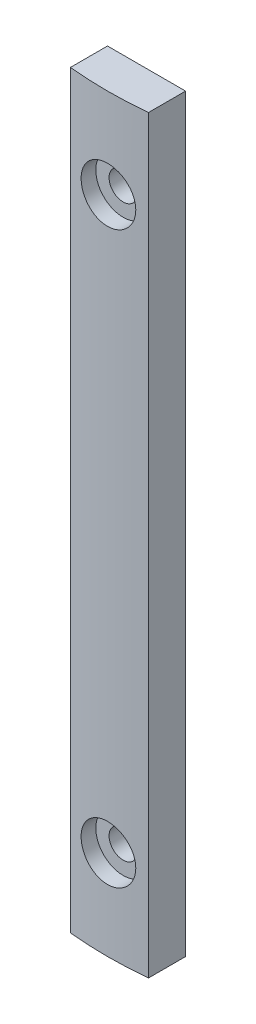
ISO-10303-21;
HEADER;
FILE_DESCRIPTION(('STEP AP214'),'2;1');
FILE_NAME('part.step','',(''),(''),'','','');
FILE_SCHEMA(('AUTOMOTIVE_DESIGN { 1 0 10303 214 1 1 1 1 }'));
ENDSEC;
DATA;
#1=APPLICATION_CONTEXT('core data for automotive mechanical design processes');
#2=APPLICATION_PROTOCOL_DEFINITION('international standard','automotive_design',2000,#1);
#3=PRODUCT_CONTEXT('',#1,'mechanical');
#4=PRODUCT('Part','Part','',(#3));
#5=PRODUCT_RELATED_PRODUCT_CATEGORY('part','',(#4));
#6=PRODUCT_DEFINITION_FORMATION('','',#4);
#7=PRODUCT_DEFINITION_CONTEXT('part definition',#1,'design');
#8=PRODUCT_DEFINITION('design','',#6,#7);
#9=PRODUCT_DEFINITION_SHAPE('','',#8);
#10=(LENGTH_UNIT() NAMED_UNIT(*) SI_UNIT(.MILLI.,.METRE.));
#11=(NAMED_UNIT(*) PLANE_ANGLE_UNIT() SI_UNIT($,.RADIAN.));
#12=(NAMED_UNIT(*) SI_UNIT($,.STERADIAN.) SOLID_ANGLE_UNIT());
#13=UNCERTAINTY_MEASURE_WITH_UNIT(LENGTH_MEASURE(1.E-05),#10,'distance_accuracy_value','');
#14=(GEOMETRIC_REPRESENTATION_CONTEXT(3) GLOBAL_UNCERTAINTY_ASSIGNED_CONTEXT((#13)) GLOBAL_UNIT_ASSIGNED_CONTEXT((#10,
#11,#12)) REPRESENTATION_CONTEXT('',''));
#15=CARTESIAN_POINT('',(0.,0.,0.));
#16=DIRECTION('',(0.,0.,1.));
#17=DIRECTION('',(1.,0.,0.));
#18=AXIS2_PLACEMENT_3D('',#15,#16,#17);
#19=CARTESIAN_POINT('',(1055.,0.,-2.2500000000001));
#20=DIRECTION('',(0.,0.,-1.));
#21=DIRECTION('',(-1.,0.,0.));
#22=AXIS2_PLACEMENT_3D('',#19,#20,#21);
#23=PLANE('',#22);
#24=DIRECTION('',(-1.,0.,0.));
#25=VECTOR('',#24,1.);
#26=CARTESIAN_POINT('',(1055.,96.,-2.2500000000001));
#27=LINE('',#26,#25);
#28=CARTESIAN_POINT('',(1055.,96.,-2.2500000000001));
#29=VERTEX_POINT('',#28);
#30=CARTESIAN_POINT('',(1045.,96.,-2.2500000000001));
#31=VERTEX_POINT('',#30);
#32=EDGE_CURVE('E90',#29,#31,#27,.T.);
#33=ORIENTED_EDGE('',*,*,#32,.F.);
#34=DIRECTION('',(0.,1.,0.));
#35=VECTOR('',#34,1.);
#36=CARTESIAN_POINT('',(1055.,0.,-2.2500000000001));
#37=LINE('',#36,#35);
#38=CARTESIAN_POINT('',(1055.,0.,-2.2500000000001));
#39=VERTEX_POINT('',#38);
#40=EDGE_CURVE('E85',#39,#29,#37,.T.);
#41=ORIENTED_EDGE('',*,*,#40,.F.);
#42=DIRECTION('',(-1.,0.,0.));
#43=VECTOR('',#42,1.);
#44=CARTESIAN_POINT('',(1055.,0.,-2.2500000000001));
#45=LINE('',#44,#43);
#46=CARTESIAN_POINT('',(1045.,0.,-2.2500000000001));
#47=VERTEX_POINT('',#46);
#48=EDGE_CURVE('E88',#39,#47,#45,.T.);
#49=ORIENTED_EDGE('',*,*,#48,.T.);
#50=DIRECTION('',(0.,1.,0.));
#51=VECTOR('',#50,1.);
#52=CARTESIAN_POINT('',(1045.,0.,-2.2500000000001));
#53=LINE('',#52,#51);
#54=EDGE_CURVE('E71',#47,#31,#53,.T.);
#55=ORIENTED_EDGE('',*,*,#54,.T.);
#56=EDGE_LOOP('',(#33,#41,#49,#55));
#57=FACE_BOUND('',#56,.T.);
#58=CARTESIAN_POINT('',(1050.,84.5,-2.25000000000015));
#59=DIRECTION('',(0.,0.,1.));
#60=DIRECTION('',(0.,-1.,0.));
#61=AXIS2_PLACEMENT_3D('',#58,#59,#60);
#62=CIRCLE('',#61,1.80000000000002);
#63=CARTESIAN_POINT('',(1050.,82.7,-2.25000000000015));
#64=VERTEX_POINT('',#63);
#65=EDGE_CURVE('E110',#64,#64,#62,.T.);
#66=ORIENTED_EDGE('',*,*,#65,.T.);
#67=EDGE_LOOP('',(#66));
#68=FACE_BOUND('',#67,.T.);
#69=CARTESIAN_POINT('',(1050.,11.5,-2.25000000000015));
#70=DIRECTION('',(0.,0.,1.));
#71=DIRECTION('',(0.,-1.,0.));
#72=AXIS2_PLACEMENT_3D('',#69,#70,#71);
#73=CIRCLE('',#72,1.80000000000002);
#74=CARTESIAN_POINT('',(1050.,9.69999999999993,-2.25000000000015));
#75=VERTEX_POINT('',#74);
#76=EDGE_CURVE('E217',#75,#75,#73,.T.);
#77=ORIENTED_EDGE('',*,*,#76,.T.);
#78=EDGE_LOOP('',(#77));
#79=FACE_BOUND('',#78,.T.);
#80=ADVANCED_FACE('F33',(#57,#68,#79),#23,.T.);
#81=CARTESIAN_POINT('',(1050.,0.,-47.2500000000024));
#82=DIRECTION('',(0.,1.,0.));
#83=DIRECTION('',(0.,0.,1.));
#84=AXIS2_PLACEMENT_3D('',#81,#82,#83);
#85=CYLINDRICAL_SURFACE('',#84,50.0000000000024);
#86=CARTESIAN_POINT('',(1050.,7.9999999999999,2.74999999999997));
#87=CARTESIAN_POINT('',(1050.19633863164,8.00000861922661,2.74999837907537));
#88=CARTESIAN_POINT('',(1050.39281349138,8.01657647331508,2.74883117932154));
#89=CARTESIAN_POINT('',(1050.78033451279,8.08242911240076,2.74428720396043));
#90=CARTESIAN_POINT('',(1050.97137414542,8.13175164559933,2.74090787904895));
#91=CARTESIAN_POINT('',(1051.3423556039,8.26168686782314,2.73232181095951));
#92=CARTESIAN_POINT('',(1051.52230336271,8.3422826577107,2.72711605487595));
#93=CARTESIAN_POINT('',(1051.86607060812,8.53244821901057,2.71546206784139));
#94=CARTESIAN_POINT('',(1052.02989369712,8.64201149853505,2.70901411536606));
#95=CARTESIAN_POINT('',(1052.33710878017,8.88722169430254,2.69558682754863));
#96=CARTESIAN_POINT('',(1052.48046707374,9.02291078980408,2.68860664409599));
#97=CARTESIAN_POINT('',(1052.74239455101,9.316432985065,2.67490879821902));
#98=CARTESIAN_POINT('',(1052.86096268193,9.47426702480381,2.6681911469538));
#99=CARTESIAN_POINT('',(1053.0700523448,9.80779526854253,2.65576920751169));
#100=CARTESIAN_POINT('',(1053.16054519221,9.98350749696826,2.6500659582717));
#101=CARTESIAN_POINT('',(1053.31073213311,10.3476782009733,2.64032721574238));
#102=CARTESIAN_POINT('',(1053.37042662712,10.5361365107658,2.63629170076589));
#103=CARTESIAN_POINT('',(1053.45722700842,10.9201193590943,2.63035175169954));
#104=CARTESIAN_POINT('',(1053.48438661502,11.115631699018,2.62844380508079));
#105=CARTESIAN_POINT('',(1053.50551213506,11.5084488101054,2.62696364499763));
#106=CARTESIAN_POINT('',(1053.49947850512,11.7057535565747,2.62739139940224));
#107=CARTESIAN_POINT('',(1053.45443333279,12.0961880046923,2.63053114409499));
#108=CARTESIAN_POINT('',(1053.41548000108,12.2893244591567,2.63323910235288));
#109=CARTESIAN_POINT('',(1053.30579150607,12.6663108154349,2.64062776358888));
#110=CARTESIAN_POINT('',(1053.23505611292,12.8501606500727,2.64530848083495));
#111=CARTESIAN_POINT('',(1053.06374562537,13.2035414789241,2.65611984863478));
#112=CARTESIAN_POINT('',(1052.96314421964,13.3730596773718,2.66225177670479));
#113=CARTESIAN_POINT('',(1052.73497644022,13.6928253364654,2.67527333775605));
#114=CARTESIAN_POINT('',(1052.60740968378,13.843072523531,2.6821629814916));
#115=CARTESIAN_POINT('',(1052.32860495015,14.1203698010281,2.69594152306346));
#116=CARTESIAN_POINT('',(1052.17731661324,14.2473692651516,2.70283038737475));
#117=CARTESIAN_POINT('',(1051.85553950076,14.4741752434368,2.71581687919966));
#118=CARTESIAN_POINT('',(1051.68505071677,14.5739817456537,2.72191450636574));
#119=CARTESIAN_POINT('',(1051.32968082988,14.7435647481782,2.73263213207799));
#120=CARTESIAN_POINT('',(1051.14479875806,14.813339224735,2.73725203103996));
#121=CARTESIAN_POINT('',(1050.76590458386,14.9208431858637,2.74449236634762));
#122=CARTESIAN_POINT('',(1050.57189261523,14.9585731397139,2.7471128319741));
#123=CARTESIAN_POINT('',(1050.18068504118,15.0008540667996,2.75005526332294));
#124=CARTESIAN_POINT('',(1049.98349703321,15.0054750135195,2.75038207648339));
#125=CARTESIAN_POINT('',(1049.59114884991,14.9815897403852,2.74871328880183));
#126=CARTESIAN_POINT('',(1049.39598866132,14.9530837374775,2.74671770316907));
#127=CARTESIAN_POINT('',(1049.01343389963,14.8638117030423,2.74063181367165));
#128=CARTESIAN_POINT('',(1048.82603177355,14.8030778835105,2.73654360155028));
#129=CARTESIAN_POINT('',(1048.46407939342,14.6511070001663,2.72673216771372));
#130=CARTESIAN_POINT('',(1048.28952928399,14.559869593175,2.72100892760384));
#131=CARTESIAN_POINT('',(1047.95791598843,14.3493040481917,2.70855793441756));
#132=CARTESIAN_POINT('',(1047.80088246197,14.2299292997303,2.70182852141866));
#133=CARTESIAN_POINT('',(1047.50905878161,13.9665453573222,2.68812767482055));
#134=CARTESIAN_POINT('',(1047.37426890115,13.8225358605944,2.68115623824751));
#135=CARTESIAN_POINT('',(1047.13052068519,13.5136678504877,2.66774291799078));
#136=CARTESIAN_POINT('',(1047.02160783291,13.3487733966137,2.66130197953631));
#137=CARTESIAN_POINT('',(1046.83301666333,13.0029962729536,2.64969120238771));
#138=CARTESIAN_POINT('',(1046.7533381288,12.8221137219886,2.64452135424811));
#139=CARTESIAN_POINT('',(1046.62555572199,12.4496594606082,2.63604265153159));
#140=CARTESIAN_POINT('',(1046.57742348016,12.2580975228791,2.63273212525151));
#141=CARTESIAN_POINT('',(1046.51400739526,11.8695871187278,2.6283408076124));
#142=CARTESIAN_POINT('',(1046.49872312701,11.6726387220646,2.62725998739073));
#143=CARTESIAN_POINT('',(1046.50144118092,11.279398169032,2.62745067978256));
#144=CARTESIAN_POINT('',(1046.51937201449,11.0831055121003,2.62871714036489));
#145=CARTESIAN_POINT('',(1046.58786278192,10.6963258301665,2.63344897436318));
#146=CARTESIAN_POINT('',(1046.63842277224,10.5058388152119,2.63691435158445));
#147=CARTESIAN_POINT('',(1046.77071981125,10.1360690501889,2.6456522545945));
#148=CARTESIAN_POINT('',(1046.85245620529,9.95678606495263,2.65092474243771));
#149=CARTESIAN_POINT('',(1047.04477685373,9.61447719039387,2.66268272532579));
#150=CARTESIAN_POINT('',(1047.15536045773,9.45145093465549,2.66916819302143));
#151=CARTESIAN_POINT('',(1047.40250308958,9.14591905638678,2.68263775318358));
#152=CARTESIAN_POINT('',(1047.53911439659,9.00345576648476,2.68962283122));
#153=CARTESIAN_POINT('',(1047.83435282273,8.74343140123123,2.70329580872768));
#154=CARTESIAN_POINT('',(1047.9929853002,8.62587640435938,2.70998363534545));
#155=CARTESIAN_POINT('',(1048.32798402583,8.41889619223114,2.72231711522717));
#156=CARTESIAN_POINT('',(1048.50437545036,8.32951167600681,2.72796125581807));
#157=CARTESIAN_POINT('',(1048.869576223,8.18173880376852,2.73755215013597));
#158=CARTESIAN_POINT('',(1049.05837082598,8.1233143653199,2.741500878758));
#159=CARTESIAN_POINT('',(1049.37358940198,8.05420552094178,2.74622811536105));
#160=CARTESIAN_POINT('',(1049.49797902258,8.03390497324474,2.74763623612626));
#161=CARTESIAN_POINT('',(1049.74822708781,8.0067994609679,2.7495226973785));
#162=CARTESIAN_POINT('',(1049.87408552982,7.9999944723798,2.7500010395196));
#163=CARTESIAN_POINT('',(1050.,7.9999999999999,2.74999999999997));
#164=B_SPLINE_CURVE_WITH_KNOTS('',3,(#86,#87,#88,#89,#90,#91,#92,#93,#94,#95,#96,#97,#98,#99,
#100,#101,#102,#103,#104,#105,#106,#107,#108,#109,#110,#111,#112,#113,#114,#115,#116,#117,#118,
#119,#120,#121,#122,#123,#124,#125,#126,#127,#128,#129,#130,#131,#132,#133,#134,#135,#136,#137,
#138,#139,#140,#141,#142,#143,#144,#145,#146,#147,#148,#149,#150,#151,#152,#153,#154,#155,#156,
#157,#158,#159,#160,#161,#162,#163),.UNSPECIFIED.,.T.,.F.,(4,2,2,2,2,2,2,2,2,2,2,2,2,2,2,2,2,2,
2,2,2,2,2,2,2,2,2,2,2,2,2,2,2,2,2,2,2,2,4),(0.,0.588556212147827,1.1777918870016,
1.76670959884713,2.35549544038453,2.94523995074923,3.53500950139001,4.12537965082144,
4.7157421228547,5.30512848072045,5.89450673073314,6.482844980475,7.07118748544074,
7.66004985378245,8.24892058096687,8.8390588134622,9.42919730518082,10.0193755580006,
10.6095451677648,11.1984671279751,11.7873852313907,12.3757158114865,12.9640530107862,
13.5533717465254,14.1426977259912,14.7330520061157,15.3234018991908,15.9132201596494,
16.5030307851019,17.0915734403965,17.6801171141911,18.2686484305506,18.8571664788072,
19.4468793278342,20.0367359217423,20.6274408396781,21.2174557977684,21.5949050793505,
21.9723536894577),.UNSPECIFIED.);
#165=CARTESIAN_POINT('',(1050.,7.9999999999999,2.74999999999997));
#166=VERTEX_POINT('',#165);
#167=EDGE_CURVE('E11',#166,#166,#164,.T.);
#168=ORIENTED_EDGE('',*,*,#167,.F.);
#169=EDGE_LOOP('',(#168));
#170=FACE_BOUND('',#169,.T.);
#171=CARTESIAN_POINT('',(1050.,80.9999999999999,2.74999999999997));
#172=CARTESIAN_POINT('',(1050.19633863164,81.0000086192267,2.74999837907537));
#173=CARTESIAN_POINT('',(1050.39281349138,81.0165764733151,2.74883117932154));
#174=CARTESIAN_POINT('',(1050.78033451279,81.0824291124008,2.74428720396043));
#175=CARTESIAN_POINT('',(1050.97137414542,81.1317516455994,2.74090787904895));
#176=CARTESIAN_POINT('',(1051.3423556039,81.2616868678232,2.73232181095951));
#177=CARTESIAN_POINT('',(1051.52230336271,81.3422826577108,2.72711605487595));
#178=CARTESIAN_POINT('',(1051.86607060812,81.5324482190107,2.71546206784138));
#179=CARTESIAN_POINT('',(1052.02989369712,81.6420114985352,2.70901411536606));
#180=CARTESIAN_POINT('',(1052.33710878017,81.8872216943026,2.69558682754862));
#181=CARTESIAN_POINT('',(1052.48046707374,82.0229107898041,2.68860664409599));
#182=CARTESIAN_POINT('',(1052.74239455101,82.316432985065,2.67490879821902));
#183=CARTESIAN_POINT('',(1052.86096268193,82.4742670248039,2.66819114695379));
#184=CARTESIAN_POINT('',(1053.0700523448,82.8077952685426,2.65576920751169));
#185=CARTESIAN_POINT('',(1053.16054519221,82.9835074969683,2.6500659582717));
#186=CARTESIAN_POINT('',(1053.31073213311,83.3476782009733,2.64032721574238));
#187=CARTESIAN_POINT('',(1053.37042662712,83.5361365107658,2.63629170076589));
#188=CARTESIAN_POINT('',(1053.45722700842,83.9201193590944,2.63035175169953));
#189=CARTESIAN_POINT('',(1053.48438661502,84.115631699018,2.62844380508079));
#190=CARTESIAN_POINT('',(1053.50551213506,84.5084488101054,2.62696364499763));
#191=CARTESIAN_POINT('',(1053.49947850512,84.7057535565747,2.62739139940223));
#192=CARTESIAN_POINT('',(1053.45443333279,85.0961880046924,2.63053114409498));
#193=CARTESIAN_POINT('',(1053.41548000108,85.2893244591567,2.63323910235288));
#194=CARTESIAN_POINT('',(1053.30579150607,85.666310815435,2.64062776358888));
#195=CARTESIAN_POINT('',(1053.23505611292,85.8501606500727,2.64530848083496));
#196=CARTESIAN_POINT('',(1053.06374562537,86.2035414789242,2.65611984863478));
#197=CARTESIAN_POINT('',(1052.96314421964,86.3730596773718,2.66225177670479));
#198=CARTESIAN_POINT('',(1052.73497644022,86.6928253364655,2.67527333775604));
#199=CARTESIAN_POINT('',(1052.60740968378,86.843072523531,2.6821629814916));
#200=CARTESIAN_POINT('',(1052.32860495015,87.1203698010282,2.69594152306347));
#201=CARTESIAN_POINT('',(1052.17731661324,87.2473692651518,2.70283038737475));
#202=CARTESIAN_POINT('',(1051.85553950076,87.4741752434369,2.71581687919967));
#203=CARTESIAN_POINT('',(1051.68505071677,87.5739817456538,2.72191450636574));
#204=CARTESIAN_POINT('',(1051.32968082988,87.7435647481783,2.73263213207799));
#205=CARTESIAN_POINT('',(1051.14479875806,87.813339224735,2.73725203103996));
#206=CARTESIAN_POINT('',(1050.76590458386,87.9208431858637,2.74449236634762));
#207=CARTESIAN_POINT('',(1050.57189261523,87.9585731397139,2.7471128319741));
#208=CARTESIAN_POINT('',(1050.18068504118,88.0008540667996,2.75005526332294));
#209=CARTESIAN_POINT('',(1049.98349703321,88.0054750135196,2.75038207648339));
#210=CARTESIAN_POINT('',(1049.59114884991,87.9815897403853,2.74871328880183));
#211=CARTESIAN_POINT('',(1049.39598866132,87.9530837374775,2.74671770316907));
#212=CARTESIAN_POINT('',(1049.01343389963,87.8638117030423,2.74063181367166));
#213=CARTESIAN_POINT('',(1048.82603177355,87.8030778835105,2.73654360155028));
#214=CARTESIAN_POINT('',(1048.46407939342,87.6511070001664,2.72673216771372));
#215=CARTESIAN_POINT('',(1048.28952928399,87.5598695931751,2.72100892760384));
#216=CARTESIAN_POINT('',(1047.95791598843,87.3493040481918,2.70855793441757));
#217=CARTESIAN_POINT('',(1047.80088246197,87.2299292997303,2.70182852141867));
#218=CARTESIAN_POINT('',(1047.50905878161,86.9665453573222,2.68812767482055));
#219=CARTESIAN_POINT('',(1047.37426890115,86.8225358605945,2.68115623824751));
#220=CARTESIAN_POINT('',(1047.13052068519,86.5136678504878,2.66774291799078));
#221=CARTESIAN_POINT('',(1047.02160783291,86.3487733966136,2.66130197953631));
#222=CARTESIAN_POINT('',(1046.83301666333,86.0029962729536,2.6496912023877));
#223=CARTESIAN_POINT('',(1046.7533381288,85.8221137219886,2.64452135424811));
#224=CARTESIAN_POINT('',(1046.62555572199,85.4496594606082,2.63604265153159));
#225=CARTESIAN_POINT('',(1046.57742348016,85.2580975228791,2.63273212525151));
#226=CARTESIAN_POINT('',(1046.51400739526,84.8695871187278,2.6283408076124));
#227=CARTESIAN_POINT('',(1046.49872312701,84.6726387220646,2.62725998739074));
#228=CARTESIAN_POINT('',(1046.50144118092,84.279398169032,2.62745067978256));
#229=CARTESIAN_POINT('',(1046.51937201449,84.0831055121004,2.62871714036488));
#230=CARTESIAN_POINT('',(1046.58786278192,83.6963258301666,2.63344897436317));
#231=CARTESIAN_POINT('',(1046.63842277224,83.5058388152119,2.63691435158445));
#232=CARTESIAN_POINT('',(1046.77071981125,83.136069050189,2.6456522545945));
#233=CARTESIAN_POINT('',(1046.85245620529,82.9567860649528,2.65092474243771));
#234=CARTESIAN_POINT('',(1047.04477685373,82.614477190394,2.66268272532578));
#235=CARTESIAN_POINT('',(1047.15536045773,82.4514509346556,2.66916819302142));
#236=CARTESIAN_POINT('',(1047.40250308958,82.1459190563869,2.68263775318357));
#237=CARTESIAN_POINT('',(1047.53911439659,82.003455766485,2.68962283121999));
#238=CARTESIAN_POINT('',(1047.83435282273,81.7434314012314,2.70329580872767));
#239=CARTESIAN_POINT('',(1047.9929853002,81.6258764043595,2.70998363534544));
#240=CARTESIAN_POINT('',(1048.32798402583,81.4188961922312,2.72231711522716));
#241=CARTESIAN_POINT('',(1048.50437545036,81.3295116760069,2.72796125581807));
#242=CARTESIAN_POINT('',(1048.869576223,81.1817388037686,2.73755215013597));
#243=CARTESIAN_POINT('',(1049.05837082598,81.12331436532,2.741500878758));
#244=CARTESIAN_POINT('',(1049.37358940198,81.0542055209418,2.74622811536105));
#245=CARTESIAN_POINT('',(1049.49797902258,81.0339049732448,2.74763623612626));
#246=CARTESIAN_POINT('',(1049.74822708781,81.006799460968,2.74952269737851));
#247=CARTESIAN_POINT('',(1049.87408552982,80.9999944723799,2.7500010395196));
#248=CARTESIAN_POINT('',(1050.,80.9999999999999,2.74999999999997));
#249=B_SPLINE_CURVE_WITH_KNOTS('',3,(#171,#172,#173,#174,#175,#176,#177,#178,#179,#180,#181,
#182,#183,#184,#185,#186,#187,#188,#189,#190,#191,#192,#193,#194,#195,#196,#197,#198,#199,#200,
#201,#202,#203,#204,#205,#206,#207,#208,#209,#210,#211,#212,#213,#214,#215,#216,#217,#218,#219,
#220,#221,#222,#223,#224,#225,#226,#227,#228,#229,#230,#231,#232,#233,#234,#235,#236,#237,#238,
#239,#240,#241,#242,#243,#244,#245,#246,#247,#248),.UNSPECIFIED.,.T.,.F.,(4,2,2,2,2,2,2,2,2,2,2,
2,2,2,2,2,2,2,2,2,2,2,2,2,2,2,2,2,2,2,2,2,2,2,2,2,2,2,4),(0.,0.588556212147826,1.17779188700161,
1.76670959884737,2.35549544038454,2.94523995074941,3.53500950139004,4.12537965082148,
4.71574212285474,5.30512848072049,5.89450673073317,6.48284498047501,7.07118748544076,
7.66004985378249,8.24892058096691,8.83905881346229,9.42919730518086,10.0193755580006,
10.6095451677648,11.1984671279751,11.7873852313907,12.3757158114865,12.9640530107863,
13.5533717465254,14.1426977259912,14.7330520061159,15.3234018991908,15.9132201596495,
16.503030785102,17.0915734403965,17.6801171141911,18.2686484305503,18.8571664788073,
19.4468793278339,20.0367359217424,20.6274408396782,21.2174557977684,21.5949050793505,
21.9723536894577),.UNSPECIFIED.);
#250=CARTESIAN_POINT('',(1050.,80.9999999999999,2.74999999999997));
#251=VERTEX_POINT('',#250);
#252=EDGE_CURVE('E46',#251,#251,#249,.T.);
#253=ORIENTED_EDGE('',*,*,#252,.F.);
#254=EDGE_LOOP('',(#253));
#255=FACE_BOUND('',#254,.T.);
#256=CARTESIAN_POINT('',(1050.,96.,-47.2500000000024));
#257=DIRECTION('',(0.,1.,0.));
#258=DIRECTION('',(0.,0.,1.));
#259=AXIS2_PLACEMENT_3D('',#256,#257,#258);
#260=CIRCLE('',#259,50.0000000000024);
#261=CARTESIAN_POINT('',(1045.,96.,2.49937185533099));
#262=VERTEX_POINT('',#261);
#263=CARTESIAN_POINT('',(1055.,96.,2.49937185533097));
#264=VERTEX_POINT('',#263);
#265=EDGE_CURVE('E106',#262,#264,#260,.T.);
#266=ORIENTED_EDGE('',*,*,#265,.F.);
#267=DIRECTION('',(0.,1.,0.));
#268=VECTOR('',#267,1.);
#269=CARTESIAN_POINT('',(1045.,0.,2.49937185533099));
#270=LINE('',#269,#268);
#271=CARTESIAN_POINT('',(1045.,0.,2.49937185533099));
#272=VERTEX_POINT('',#271);
#273=EDGE_CURVE('E54',#272,#262,#270,.T.);
#274=ORIENTED_EDGE('',*,*,#273,.F.);
#275=CARTESIAN_POINT('',(1050.,0.,-47.2500000000024));
#276=DIRECTION('',(0.,1.,0.));
#277=DIRECTION('',(0.,0.,1.));
#278=AXIS2_PLACEMENT_3D('',#275,#276,#277);
#279=CIRCLE('',#278,50.0000000000024);
#280=CARTESIAN_POINT('',(1055.,0.,2.49937185533097));
#281=VERTEX_POINT('',#280);
#282=EDGE_CURVE('E99',#272,#281,#279,.T.);
#283=ORIENTED_EDGE('',*,*,#282,.T.);
#284=DIRECTION('',(0.,1.,0.));
#285=VECTOR('',#284,1.);
#286=CARTESIAN_POINT('',(1055.,0.,2.49937185533097));
#287=LINE('',#286,#285);
#288=EDGE_CURVE('E82',#281,#264,#287,.T.);
#289=ORIENTED_EDGE('',*,*,#288,.T.);
#290=EDGE_LOOP('',(#266,#274,#283,#289));
#291=FACE_BOUND('',#290,.T.);
#292=ADVANCED_FACE('F35',(#170,#255,#291),#85,.T.);
#293=CARTESIAN_POINT('',(1045.,0.,-2.2500000000001));
#294=DIRECTION('',(-1.,0.,0.));
#295=DIRECTION('',(0.,0.,1.));
#296=AXIS2_PLACEMENT_3D('',#293,#294,#295);
#297=PLANE('',#296);
#298=DIRECTION('',(0.,0.,1.));
#299=VECTOR('',#298,1.);
#300=CARTESIAN_POINT('',(1045.,96.,-2.2500000000001));
#301=LINE('',#300,#299);
#302=EDGE_CURVE('E101',#31,#262,#301,.T.);
#303=ORIENTED_EDGE('',*,*,#302,.F.);
#304=ORIENTED_EDGE('',*,*,#54,.F.);
#305=DIRECTION('',(0.,0.,1.));
#306=VECTOR('',#305,1.);
#307=CARTESIAN_POINT('',(1045.,0.,-2.2500000000001));
#308=LINE('',#307,#306);
#309=EDGE_CURVE('E96',#47,#272,#308,.T.);
#310=ORIENTED_EDGE('',*,*,#309,.T.);
#311=ORIENTED_EDGE('',*,*,#273,.T.);
#312=EDGE_LOOP('',(#303,#304,#310,#311));
#313=FACE_BOUND('',#312,.T.);
#314=ADVANCED_FACE('F143',(#313),#297,.T.);
#315=CARTESIAN_POINT('',(1055.,0.,2.49937185533097));
#316=DIRECTION('',(1.,0.,0.));
#317=DIRECTION('',(0.,0.,-1.));
#318=AXIS2_PLACEMENT_3D('',#315,#316,#317);
#319=PLANE('',#318);
#320=DIRECTION('',(0.,0.,-1.));
#321=VECTOR('',#320,1.);
#322=CARTESIAN_POINT('',(1055.,96.,2.49937185533097));
#323=LINE('',#322,#321);
#324=EDGE_CURVE('E109',#264,#29,#323,.T.);
#325=ORIENTED_EDGE('',*,*,#324,.F.);
#326=ORIENTED_EDGE('',*,*,#288,.F.);
#327=DIRECTION('',(0.,0.,-1.));
#328=VECTOR('',#327,1.);
#329=CARTESIAN_POINT('',(1055.,0.,2.49937185533097));
#330=LINE('',#329,#328);
#331=EDGE_CURVE('E95',#281,#39,#330,.T.);
#332=ORIENTED_EDGE('',*,*,#331,.T.);
#333=ORIENTED_EDGE('',*,*,#40,.T.);
#334=EDGE_LOOP('',(#325,#326,#332,#333));
#335=FACE_BOUND('',#334,.T.);
#336=ADVANCED_FACE('F98',(#335),#319,.T.);
#337=CARTESIAN_POINT('',(1050.,0.,-47.2500000000024));
#338=DIRECTION('',(0.,1.,0.));
#339=DIRECTION('',(0.,0.,1.));
#340=AXIS2_PLACEMENT_3D('',#337,#338,#339);
#341=PLANE('',#340);
#342=ORIENTED_EDGE('',*,*,#282,.F.);
#343=ORIENTED_EDGE('',*,*,#309,.F.);
#344=ORIENTED_EDGE('',*,*,#48,.F.);
#345=ORIENTED_EDGE('',*,*,#331,.F.);
#346=EDGE_LOOP('',(#342,#343,#344,#345));
#347=FACE_BOUND('',#346,.T.);
#348=ADVANCED_FACE('F94',(#347),#341,.F.);
#349=CARTESIAN_POINT('',(1050.,96.,-47.2500000000024));
#350=DIRECTION('',(0.,1.,0.));
#351=DIRECTION('',(0.,0.,1.));
#352=AXIS2_PLACEMENT_3D('',#349,#350,#351);
#353=PLANE('',#352);
#354=ORIENTED_EDGE('',*,*,#265,.T.);
#355=ORIENTED_EDGE('',*,*,#324,.T.);
#356=ORIENTED_EDGE('',*,*,#32,.T.);
#357=ORIENTED_EDGE('',*,*,#302,.T.);
#358=EDGE_LOOP('',(#354,#355,#356,#357));
#359=FACE_BOUND('',#358,.T.);
#360=ADVANCED_FACE('F136',(#359),#353,.T.);
#361=CARTESIAN_POINT('',(1050.,84.5,2.74999999999997));
#362=DIRECTION('',(0.,0.,1.));
#363=DIRECTION('',(0.,-1.,0.));
#364=AXIS2_PLACEMENT_3D('',#361,#362,#363);
#365=CYLINDRICAL_SURFACE('',#364,1.80000000000002);
#366=ORIENTED_EDGE('',*,*,#65,.F.);
#367=EDGE_LOOP('',(#366));
#368=FACE_BOUND('',#367,.T.);
#369=CARTESIAN_POINT('',(1050.,84.5,0.749999999999862));
#370=DIRECTION('',(0.,0.,1.));
#371=DIRECTION('',(0.,-1.,0.));
#372=AXIS2_PLACEMENT_3D('',#369,#370,#371);
#373=CIRCLE('',#372,1.80000000000002);
#374=CARTESIAN_POINT('',(1050.,82.7,0.749999999999863));
#375=VERTEX_POINT('',#374);
#376=EDGE_CURVE('E225',#375,#375,#373,.T.);
#377=ORIENTED_EDGE('',*,*,#376,.T.);
#378=EDGE_LOOP('',(#377));
#379=FACE_BOUND('',#378,.T.);
#380=ADVANCED_FACE('F132',(#368,#379),#365,.F.);
#381=CARTESIAN_POINT('',(1051.8,84.5,0.749999999999862));
#382=DIRECTION('',(0.,0.,-1.));
#383=DIRECTION('',(0.,1.,0.));
#384=AXIS2_PLACEMENT_3D('',#381,#382,#383);
#385=PLANE('',#384);
#386=ORIENTED_EDGE('',*,*,#376,.F.);
#387=EDGE_LOOP('',(#386));
#388=FACE_BOUND('',#387,.T.);
#389=CARTESIAN_POINT('',(1050.,84.5,0.749999999999862));
#390=DIRECTION('',(0.,0.,1.));
#391=DIRECTION('',(0.,-1.,0.));
#392=AXIS2_PLACEMENT_3D('',#389,#390,#391);
#393=CIRCLE('',#392,3.50000000000006);
#394=CARTESIAN_POINT('',(1050.,80.9999999999999,0.749999999999864));
#395=VERTEX_POINT('',#394);
#396=EDGE_CURVE('E222',#395,#395,#393,.T.);
#397=ORIENTED_EDGE('',*,*,#396,.T.);
#398=EDGE_LOOP('',(#397));
#399=FACE_BOUND('',#398,.T.);
#400=ADVANCED_FACE('F127',(#388,#399),#385,.F.);
#401=CARTESIAN_POINT('',(1050.,84.5,2.74999999999997));
#402=DIRECTION('',(0.,0.,1.));
#403=DIRECTION('',(0.,-1.,0.));
#404=AXIS2_PLACEMENT_3D('',#401,#402,#403);
#405=CYLINDRICAL_SURFACE('',#404,3.50000000000006);
#406=ORIENTED_EDGE('',*,*,#252,.T.);
#407=EDGE_LOOP('',(#406));
#408=FACE_BOUND('',#407,.T.);
#409=ORIENTED_EDGE('',*,*,#396,.F.);
#410=EDGE_LOOP('',(#409));
#411=FACE_BOUND('',#410,.T.);
#412=ADVANCED_FACE('F121',(#408,#411),#405,.F.);
#413=CARTESIAN_POINT('',(1050.,11.5,2.74999999999997));
#414=DIRECTION('',(0.,0.,1.));
#415=DIRECTION('',(0.,-1.,0.));
#416=AXIS2_PLACEMENT_3D('',#413,#414,#415);
#417=CYLINDRICAL_SURFACE('',#416,1.80000000000002);
#418=ORIENTED_EDGE('',*,*,#76,.F.);
#419=EDGE_LOOP('',(#418));
#420=FACE_BOUND('',#419,.T.);
#421=CARTESIAN_POINT('',(1050.,11.5,0.749999999999862));
#422=DIRECTION('',(0.,0.,1.));
#423=DIRECTION('',(0.,-1.,0.));
#424=AXIS2_PLACEMENT_3D('',#421,#422,#423);
#425=CIRCLE('',#424,1.80000000000002);
#426=CARTESIAN_POINT('',(1050.,9.69999999999993,0.749999999999861));
#427=VERTEX_POINT('',#426);
#428=EDGE_CURVE('E214',#427,#427,#425,.T.);
#429=ORIENTED_EDGE('',*,*,#428,.T.);
#430=EDGE_LOOP('',(#429));
#431=FACE_BOUND('',#430,.T.);
#432=ADVANCED_FACE('F126',(#420,#431),#417,.F.);
#433=CARTESIAN_POINT('',(1051.8,11.5,0.749999999999862));
#434=DIRECTION('',(0.,0.,-1.));
#435=DIRECTION('',(0.,1.,0.));
#436=AXIS2_PLACEMENT_3D('',#433,#434,#435);
#437=PLANE('',#436);
#438=ORIENTED_EDGE('',*,*,#428,.F.);
#439=EDGE_LOOP('',(#438));
#440=FACE_BOUND('',#439,.T.);
#441=CARTESIAN_POINT('',(1050.,11.5,0.749999999999862));
#442=DIRECTION('',(0.,0.,1.));
#443=DIRECTION('',(0.,-1.,0.));
#444=AXIS2_PLACEMENT_3D('',#441,#442,#443);
#445=CIRCLE('',#444,3.50000000000006);
#446=CARTESIAN_POINT('',(1050.,7.9999999999999,0.74999999999986));
#447=VERTEX_POINT('',#446);
#448=EDGE_CURVE('E212',#447,#447,#445,.T.);
#449=ORIENTED_EDGE('',*,*,#448,.T.);
#450=EDGE_LOOP('',(#449));
#451=FACE_BOUND('',#450,.T.);
#452=ADVANCED_FACE('F185',(#440,#451),#437,.F.);
#453=CARTESIAN_POINT('',(1050.,11.5,2.74999999999997));
#454=DIRECTION('',(0.,0.,1.));
#455=DIRECTION('',(0.,-1.,0.));
#456=AXIS2_PLACEMENT_3D('',#453,#454,#455);
#457=CYLINDRICAL_SURFACE('',#456,3.50000000000006);
#458=ORIENTED_EDGE('',*,*,#167,.T.);
#459=EDGE_LOOP('',(#458));
#460=FACE_BOUND('',#459,.T.);
#461=ORIENTED_EDGE('',*,*,#448,.F.);
#462=EDGE_LOOP('',(#461));
#463=FACE_BOUND('',#462,.T.);
#464=ADVANCED_FACE('F192',(#460,#463),#457,.F.);
#465=CLOSED_SHELL('',(#80,#292,#314,#336,#348,#360,#380,#400,#412,#432,#452,#464));
#466=MANIFOLD_SOLID_BREP('B2',#465);
#467=ADVANCED_BREP_SHAPE_REPRESENTATION('',(#18,#466),#14);
#468=SHAPE_DEFINITION_REPRESENTATION(#9,#467);
ENDSEC;
END-ISO-10303-21;
